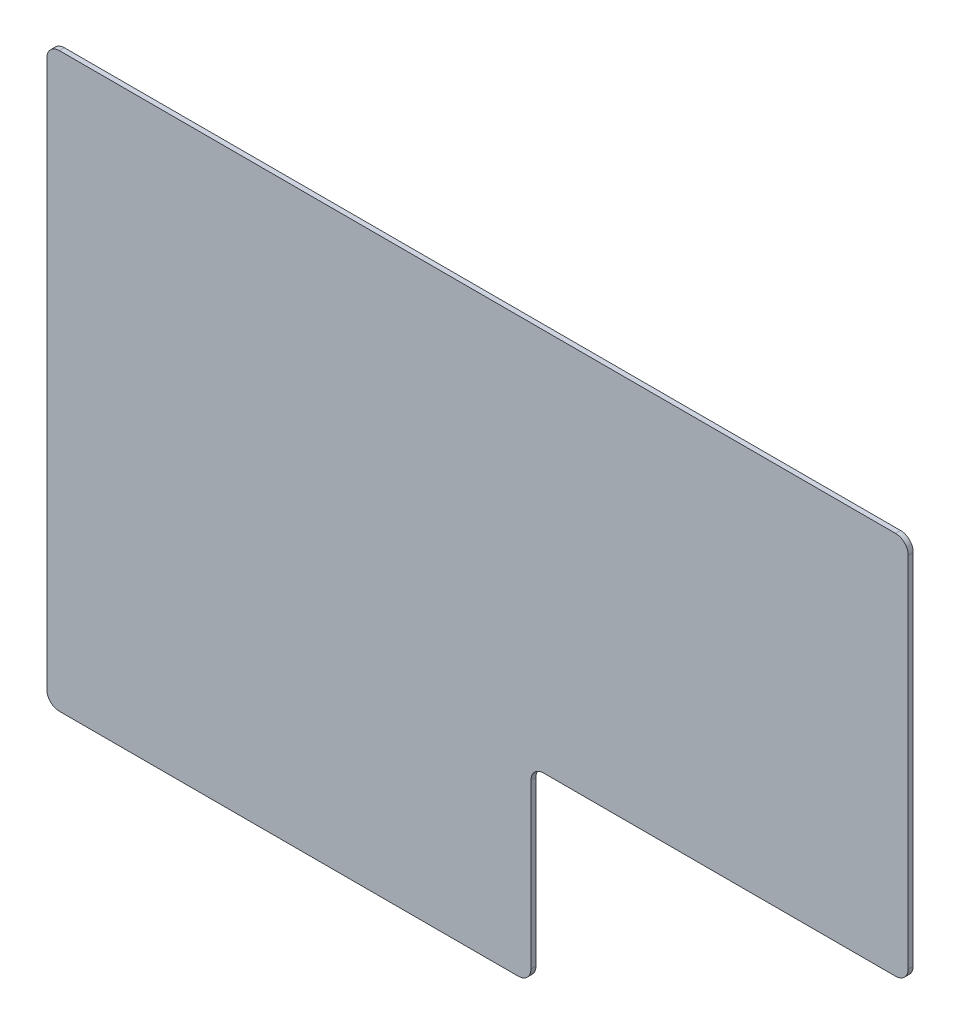
ISO-10303-21;
HEADER;
FILE_DESCRIPTION(('STEP AP214'),'2;1');
FILE_NAME('part.step','',(''),(''),'','','');
FILE_SCHEMA(('AUTOMOTIVE_DESIGN { 1 0 10303 214 1 1 1 1 }'));
ENDSEC;
DATA;
#1=APPLICATION_CONTEXT('core data for automotive mechanical design processes');
#2=APPLICATION_PROTOCOL_DEFINITION('international standard','automotive_design',2000,#1);
#3=PRODUCT_CONTEXT('',#1,'mechanical');
#4=PRODUCT('Part','Part','',(#3));
#5=PRODUCT_RELATED_PRODUCT_CATEGORY('part','',(#4));
#6=PRODUCT_DEFINITION_FORMATION('','',#4);
#7=PRODUCT_DEFINITION_CONTEXT('part definition',#1,'design');
#8=PRODUCT_DEFINITION('design','',#6,#7);
#9=PRODUCT_DEFINITION_SHAPE('','',#8);
#10=(LENGTH_UNIT() NAMED_UNIT(*) SI_UNIT(.MILLI.,.METRE.));
#11=(NAMED_UNIT(*) PLANE_ANGLE_UNIT() SI_UNIT($,.RADIAN.));
#12=(NAMED_UNIT(*) SI_UNIT($,.STERADIAN.) SOLID_ANGLE_UNIT());
#13=UNCERTAINTY_MEASURE_WITH_UNIT(LENGTH_MEASURE(1.E-05),#10,'distance_accuracy_value','');
#14=(GEOMETRIC_REPRESENTATION_CONTEXT(3) GLOBAL_UNCERTAINTY_ASSIGNED_CONTEXT((#13)) GLOBAL_UNIT_ASSIGNED_CONTEXT((#10,
#11,#12)) REPRESENTATION_CONTEXT('',''));
#15=CARTESIAN_POINT('',(0.,0.,0.));
#16=DIRECTION('',(0.,0.,1.));
#17=DIRECTION('',(1.,0.,0.));
#18=AXIS2_PLACEMENT_3D('',#15,#16,#17);
#19=CARTESIAN_POINT('',(-0.0949999999996768,0.164999999999999,0.));
#20=DIRECTION('',(0.,0.,1.));
#21=DIRECTION('',(1.,0.,0.));
#22=AXIS2_PLACEMENT_3D('',#19,#20,#21);
#23=PLANE('',#22);
#24=DIRECTION('',(0.,1.,0.));
#25=VECTOR('',#24,1.);
#26=CARTESIAN_POINT('',(-0.194999999999705,4.51500000150653,0.));
#27=LINE('',#26,#25);
#28=CARTESIAN_POINT('',(-0.194999999999676,0.164999999999999,0.));
#29=VERTEX_POINT('',#28);
#30=CARTESIAN_POINT('',(-0.194999999999705,4.51500000150653,0.));
#31=VERTEX_POINT('',#30);
#32=EDGE_CURVE('E106',#29,#31,#27,.T.);
#33=ORIENTED_EDGE('',*,*,#32,.T.);
#34=CARTESIAN_POINT('',(-0.0949999999997042,4.51500000150653,0.));
#35=DIRECTION('',(0.,0.,-1.));
#36=DIRECTION('',(-1.,0.,0.));
#37=AXIS2_PLACEMENT_3D('',#34,#35,#36);
#38=CIRCLE('',#37,0.100000000000001);
#39=CARTESIAN_POINT('',(-0.0949999999997038,4.61500000150653,0.));
#40=VERTEX_POINT('',#39);
#41=EDGE_CURVE('E129',#40,#31,#38,.F.);
#42=ORIENTED_EDGE('',*,*,#41,.F.);
#43=DIRECTION('',(1.,0.,0.));
#44=VECTOR('',#43,1.);
#45=CARTESIAN_POINT('',(6.5550000000003,4.61500000150653,0.));
#46=LINE('',#45,#44);
#47=CARTESIAN_POINT('',(6.5550000000003,4.61500000150653,0.));
#48=VERTEX_POINT('',#47);
#49=EDGE_CURVE('E126',#40,#48,#46,.T.);
#50=ORIENTED_EDGE('',*,*,#49,.T.);
#51=CARTESIAN_POINT('',(6.5550000000003,4.51500000150653,0.));
#52=DIRECTION('',(0.,0.,-1.));
#53=DIRECTION('',(-1.,0.,0.));
#54=AXIS2_PLACEMENT_3D('',#51,#52,#53);
#55=CIRCLE('',#54,0.1);
#56=CARTESIAN_POINT('',(6.6550000000003,4.51500000150653,0.));
#57=VERTEX_POINT('',#56);
#58=EDGE_CURVE('E134',#57,#48,#55,.F.);
#59=ORIENTED_EDGE('',*,*,#58,.F.);
#60=DIRECTION('',(0.,-1.,0.));
#61=VECTOR('',#60,1.);
#62=CARTESIAN_POINT('',(6.65500000000032,1.665,0.));
#63=LINE('',#62,#61);
#64=CARTESIAN_POINT('',(6.65500000000032,1.665,0.));
#65=VERTEX_POINT('',#64);
#66=EDGE_CURVE('E131',#57,#65,#63,.T.);
#67=ORIENTED_EDGE('',*,*,#66,.T.);
#68=CARTESIAN_POINT('',(6.55500000000032,1.665,0.));
#69=DIRECTION('',(0.,0.,-1.));
#70=DIRECTION('',(-1.,0.,0.));
#71=AXIS2_PLACEMENT_3D('',#68,#69,#70);
#72=CIRCLE('',#71,0.0999999999999994);
#73=CARTESIAN_POINT('',(6.55500000000032,1.565,0.));
#74=VERTEX_POINT('',#73);
#75=EDGE_CURVE('E139',#74,#65,#72,.F.);
#76=ORIENTED_EDGE('',*,*,#75,.F.);
#77=DIRECTION('',(1.,0.,0.));
#78=VECTOR('',#77,1.);
#79=CARTESIAN_POINT('',(3.75500000107356,1.565,0.));
#80=LINE('',#79,#78);
#81=CARTESIAN_POINT('',(3.75500000107356,1.565,0.));
#82=VERTEX_POINT('',#81);
#83=EDGE_CURVE('E136',#74,#82,#80,.F.);
#84=ORIENTED_EDGE('',*,*,#83,.T.);
#85=CARTESIAN_POINT('',(3.75500000107356,1.465,0.));
#86=DIRECTION('',(0.,0.,-1.));
#87=DIRECTION('',(-1.,0.,0.));
#88=AXIS2_PLACEMENT_3D('',#85,#86,#87);
#89=CIRCLE('',#88,0.0999999999999998);
#90=CARTESIAN_POINT('',(3.65500000107356,1.465,0.));
#91=VERTEX_POINT('',#90);
#92=EDGE_CURVE('E172',#82,#91,#89,.F.);
#93=ORIENTED_EDGE('',*,*,#92,.T.);
#94=DIRECTION('',(0.,-1.,0.));
#95=VECTOR('',#94,1.);
#96=CARTESIAN_POINT('',(3.65500000107357,0.164999999999999,0.));
#97=LINE('',#96,#95);
#98=CARTESIAN_POINT('',(3.65500000107357,0.164999999999998,0.));
#99=VERTEX_POINT('',#98);
#100=EDGE_CURVE('E141',#91,#99,#97,.T.);
#101=ORIENTED_EDGE('',*,*,#100,.T.);
#102=CARTESIAN_POINT('',(3.55500000107357,0.164999999999998,0.));
#103=DIRECTION('',(0.,0.,-1.));
#104=DIRECTION('',(-1.,0.,0.));
#105=AXIS2_PLACEMENT_3D('',#102,#103,#104);
#106=CIRCLE('',#105,0.099999999999999);
#107=CARTESIAN_POINT('',(3.55500000107357,0.0649999999999992,0.));
#108=VERTEX_POINT('',#107);
#109=EDGE_CURVE('E147',#108,#99,#106,.F.);
#110=ORIENTED_EDGE('',*,*,#109,.F.);
#111=DIRECTION('',(1.,0.,0.));
#112=VECTOR('',#111,1.);
#113=CARTESIAN_POINT('',(-0.094999999999678,0.0649999999999991,0.));
#114=LINE('',#113,#112);
#115=CARTESIAN_POINT('',(-0.0949999999996774,0.0649999999999991,0.));
#116=VERTEX_POINT('',#115);
#117=EDGE_CURVE('E108',#108,#116,#114,.F.);
#118=ORIENTED_EDGE('',*,*,#117,.T.);
#119=CARTESIAN_POINT('',(-0.0949999999996768,0.164999999999999,0.));
#120=DIRECTION('',(0.,0.,-1.));
#121=DIRECTION('',(-1.,0.,0.));
#122=AXIS2_PLACEMENT_3D('',#119,#120,#121);
#123=CIRCLE('',#122,0.0999999999999995);
#124=EDGE_CURVE('E20',#29,#116,#123,.F.);
#125=ORIENTED_EDGE('',*,*,#124,.F.);
#126=EDGE_LOOP('',(#33,#42,#50,#59,#67,#76,#84,#93,#101,#110,#118,#125));
#127=FACE_BOUND('',#126,.T.);
#128=ADVANCED_FACE('F17',(#127),#23,.F.);
#129=CARTESIAN_POINT('',(-0.0949999999996768,0.164999999999999,0.04));
#130=DIRECTION('',(0.,0.,-1.));
#131=DIRECTION('',(-1.,0.,0.));
#132=AXIS2_PLACEMENT_3D('',#129,#130,#131);
#133=CYLINDRICAL_SURFACE('',#132,0.0999999999999995);
#134=CARTESIAN_POINT('',(-0.0949999999996768,0.164999999999999,0.04));
#135=DIRECTION('',(0.,0.,-1.));
#136=DIRECTION('',(-1.,0.,0.));
#137=AXIS2_PLACEMENT_3D('',#134,#135,#136);
#138=CIRCLE('',#137,0.0999999999999995);
#139=CARTESIAN_POINT('',(-0.194999999999691,0.164999999999999,0.04));
#140=VERTEX_POINT('',#139);
#141=CARTESIAN_POINT('',(-0.0949999999996774,0.0649999999999991,0.04));
#142=VERTEX_POINT('',#141);
#143=EDGE_CURVE('E116',#140,#142,#138,.F.);
#144=ORIENTED_EDGE('',*,*,#143,.F.);
#145=DIRECTION('',(0.,0.,1.));
#146=VECTOR('',#145,1.);
#147=CARTESIAN_POINT('',(-0.194999999999676,0.164999999999999,0.04));
#148=LINE('',#147,#146);
#149=EDGE_CURVE('E113',#140,#29,#148,.F.);
#150=ORIENTED_EDGE('',*,*,#149,.T.);
#151=ORIENTED_EDGE('',*,*,#124,.T.);
#152=DIRECTION('',(0.,0.,1.));
#153=VECTOR('',#152,1.);
#154=CARTESIAN_POINT('',(-0.094999999999678,0.0649999999999991,0.04));
#155=LINE('',#154,#153);
#156=EDGE_CURVE('E111',#116,#142,#155,.T.);
#157=ORIENTED_EDGE('',*,*,#156,.T.);
#158=EDGE_LOOP('',(#144,#150,#151,#157));
#159=FACE_BOUND('',#158,.T.);
#160=ADVANCED_FACE('F114',(#159),#133,.T.);
#161=CARTESIAN_POINT('',(-0.094999999999678,0.0649999999999991,0.04));
#162=DIRECTION('',(0.,1.,0.));
#163=DIRECTION('',(0.,0.,1.));
#164=AXIS2_PLACEMENT_3D('',#161,#162,#163);
#165=PLANE('',#164);
#166=DIRECTION('',(0.,0.,-1.));
#167=VECTOR('',#166,1.);
#168=CARTESIAN_POINT('',(3.55500000107357,0.0649999999999993,0.04));
#169=LINE('',#168,#167);
#170=CARTESIAN_POINT('',(3.55500000107357,0.0649999999999992,0.04));
#171=VERTEX_POINT('',#170);
#172=EDGE_CURVE('E174',#171,#108,#169,.T.);
#173=ORIENTED_EDGE('',*,*,#172,.F.);
#174=DIRECTION('',(1.,0.,0.));
#175=VECTOR('',#174,1.);
#176=CARTESIAN_POINT('',(-0.0949999999996768,0.0649999999999991,0.04));
#177=LINE('',#176,#175);
#178=EDGE_CURVE('E121',#142,#171,#177,.T.);
#179=ORIENTED_EDGE('',*,*,#178,.F.);
#180=ORIENTED_EDGE('',*,*,#156,.F.);
#181=ORIENTED_EDGE('',*,*,#117,.F.);
#182=EDGE_LOOP('',(#173,#179,#180,#181));
#183=FACE_BOUND('',#182,.T.);
#184=ADVANCED_FACE('F311',(#183),#165,.F.);
#185=CARTESIAN_POINT('',(3.55500000107357,0.164999999999998,0.04));
#186=DIRECTION('',(0.,0.,-1.));
#187=DIRECTION('',(-1.,0.,0.));
#188=AXIS2_PLACEMENT_3D('',#185,#186,#187);
#189=CYLINDRICAL_SURFACE('',#188,0.099999999999999);
#190=CARTESIAN_POINT('',(3.55500000107357,0.164999999999998,0.04));
#191=DIRECTION('',(0.,0.,-1.));
#192=DIRECTION('',(-1.,0.,0.));
#193=AXIS2_PLACEMENT_3D('',#190,#191,#192);
#194=CIRCLE('',#193,0.099999999999999);
#195=CARTESIAN_POINT('',(3.65500000107357,0.164999999999998,0.04));
#196=VERTEX_POINT('',#195);
#197=EDGE_CURVE('E163',#171,#196,#194,.F.);
#198=ORIENTED_EDGE('',*,*,#197,.F.);
#199=ORIENTED_EDGE('',*,*,#172,.T.);
#200=ORIENTED_EDGE('',*,*,#109,.T.);
#201=DIRECTION('',(0.,0.,1.));
#202=VECTOR('',#201,1.);
#203=CARTESIAN_POINT('',(3.65500000107357,0.164999999999998,0.04));
#204=LINE('',#203,#202);
#205=EDGE_CURVE('E145',#99,#196,#204,.T.);
#206=ORIENTED_EDGE('',*,*,#205,.T.);
#207=EDGE_LOOP('',(#198,#199,#200,#206));
#208=FACE_BOUND('',#207,.T.);
#209=ADVANCED_FACE('F301',(#208),#189,.T.);
#210=CARTESIAN_POINT('',(3.65500000107357,0.164999999999999,0.04));
#211=DIRECTION('',(-1.,0.,0.));
#212=DIRECTION('',(0.,-1.,0.));
#213=AXIS2_PLACEMENT_3D('',#210,#211,#212);
#214=PLANE('',#213);
#215=DIRECTION('',(0.,0.,-1.));
#216=VECTOR('',#215,1.);
#217=CARTESIAN_POINT('',(3.65500000107356,1.465,0.04));
#218=LINE('',#217,#216);
#219=CARTESIAN_POINT('',(3.65500000107357,1.465,0.04));
#220=VERTEX_POINT('',#219);
#221=EDGE_CURVE('E144',#91,#220,#218,.F.);
#222=ORIENTED_EDGE('',*,*,#221,.T.);
#223=DIRECTION('',(0.,1.,0.));
#224=VECTOR('',#223,1.);
#225=CARTESIAN_POINT('',(3.65500000107357,0.164999999999999,0.04));
#226=LINE('',#225,#224);
#227=EDGE_CURVE('E162',#196,#220,#226,.T.);
#228=ORIENTED_EDGE('',*,*,#227,.F.);
#229=ORIENTED_EDGE('',*,*,#205,.F.);
#230=ORIENTED_EDGE('',*,*,#100,.F.);
#231=EDGE_LOOP('',(#222,#228,#229,#230));
#232=FACE_BOUND('',#231,.T.);
#233=ADVANCED_FACE('F291',(#232),#214,.F.);
#234=CARTESIAN_POINT('',(3.75500000107356,1.465,0.04));
#235=DIRECTION('',(0.,0.,-1.));
#236=DIRECTION('',(-1.,0.,0.));
#237=AXIS2_PLACEMENT_3D('',#234,#235,#236);
#238=CYLINDRICAL_SURFACE('',#237,0.0999999999999998);
#239=DIRECTION('',(0.,0.,1.));
#240=VECTOR('',#239,1.);
#241=CARTESIAN_POINT('',(3.75500000107356,1.565,0.04));
#242=LINE('',#241,#240);
#243=CARTESIAN_POINT('',(3.75500000107356,1.565,0.04));
#244=VERTEX_POINT('',#243);
#245=EDGE_CURVE('E140',#82,#244,#242,.T.);
#246=ORIENTED_EDGE('',*,*,#245,.T.);
#247=CARTESIAN_POINT('',(3.75500000107356,1.465,0.04));
#248=DIRECTION('',(0.,0.,-1.));
#249=DIRECTION('',(-1.,0.,0.));
#250=AXIS2_PLACEMENT_3D('',#247,#248,#249);
#251=CIRCLE('',#250,0.0999999999999998);
#252=EDGE_CURVE('E159',#220,#244,#251,.T.);
#253=ORIENTED_EDGE('',*,*,#252,.F.);
#254=ORIENTED_EDGE('',*,*,#221,.F.);
#255=ORIENTED_EDGE('',*,*,#92,.F.);
#256=EDGE_LOOP('',(#246,#253,#254,#255));
#257=FACE_BOUND('',#256,.T.);
#258=ADVANCED_FACE('F281',(#257),#238,.F.);
#259=CARTESIAN_POINT('',(3.75500000107356,1.565,0.04));
#260=DIRECTION('',(0.,1.,0.));
#261=DIRECTION('',(0.,0.,1.));
#262=AXIS2_PLACEMENT_3D('',#259,#260,#261);
#263=PLANE('',#262);
#264=DIRECTION('',(0.,0.,-1.));
#265=VECTOR('',#264,1.);
#266=CARTESIAN_POINT('',(6.55500000000032,1.565,0.04));
#267=LINE('',#266,#265);
#268=CARTESIAN_POINT('',(6.55500000000032,1.565,0.04));
#269=VERTEX_POINT('',#268);
#270=EDGE_CURVE('E171',#269,#74,#267,.T.);
#271=ORIENTED_EDGE('',*,*,#270,.F.);
#272=DIRECTION('',(1.,0.,0.));
#273=VECTOR('',#272,1.);
#274=CARTESIAN_POINT('',(-0.0949999999996768,1.565,0.04));
#275=LINE('',#274,#273);
#276=EDGE_CURVE('E158',#244,#269,#275,.T.);
#277=ORIENTED_EDGE('',*,*,#276,.F.);
#278=ORIENTED_EDGE('',*,*,#245,.F.);
#279=ORIENTED_EDGE('',*,*,#83,.F.);
#280=EDGE_LOOP('',(#271,#277,#278,#279));
#281=FACE_BOUND('',#280,.T.);
#282=ADVANCED_FACE('F271',(#281),#263,.F.);
#283=CARTESIAN_POINT('',(6.55500000000032,1.665,0.04));
#284=DIRECTION('',(0.,0.,-1.));
#285=DIRECTION('',(-1.,0.,0.));
#286=AXIS2_PLACEMENT_3D('',#283,#284,#285);
#287=CYLINDRICAL_SURFACE('',#286,0.0999999999999994);
#288=CARTESIAN_POINT('',(6.55500000000032,1.665,0.04));
#289=DIRECTION('',(0.,0.,-1.));
#290=DIRECTION('',(-1.,0.,0.));
#291=AXIS2_PLACEMENT_3D('',#288,#289,#290);
#292=CIRCLE('',#291,0.0999999999999994);
#293=CARTESIAN_POINT('',(6.65500000000032,1.665,0.04));
#294=VERTEX_POINT('',#293);
#295=EDGE_CURVE('E155',#269,#294,#292,.F.);
#296=ORIENTED_EDGE('',*,*,#295,.F.);
#297=ORIENTED_EDGE('',*,*,#270,.T.);
#298=ORIENTED_EDGE('',*,*,#75,.T.);
#299=DIRECTION('',(0.,0.,1.));
#300=VECTOR('',#299,1.);
#301=CARTESIAN_POINT('',(6.65500000000032,1.665,0.04));
#302=LINE('',#301,#300);
#303=EDGE_CURVE('E135',#65,#294,#302,.T.);
#304=ORIENTED_EDGE('',*,*,#303,.T.);
#305=EDGE_LOOP('',(#296,#297,#298,#304));
#306=FACE_BOUND('',#305,.T.);
#307=ADVANCED_FACE('F261',(#306),#287,.T.);
#308=CARTESIAN_POINT('',(6.65500000000032,1.665,0.04));
#309=DIRECTION('',(-1.,0.,0.));
#310=DIRECTION('',(0.,-1.,0.));
#311=AXIS2_PLACEMENT_3D('',#308,#309,#310);
#312=PLANE('',#311);
#313=DIRECTION('',(0.,0.,-1.));
#314=VECTOR('',#313,1.);
#315=CARTESIAN_POINT('',(6.6550000000003,4.51500000150653,0.04));
#316=LINE('',#315,#314);
#317=CARTESIAN_POINT('',(6.65500000000031,4.51500000150653,0.04));
#318=VERTEX_POINT('',#317);
#319=EDGE_CURVE('E169',#318,#57,#316,.T.);
#320=ORIENTED_EDGE('',*,*,#319,.F.);
#321=DIRECTION('',(0.,1.,0.));
#322=VECTOR('',#321,1.);
#323=CARTESIAN_POINT('',(6.65500000000032,0.164999999999999,0.04));
#324=LINE('',#323,#322);
#325=EDGE_CURVE('E154',#294,#318,#324,.T.);
#326=ORIENTED_EDGE('',*,*,#325,.F.);
#327=ORIENTED_EDGE('',*,*,#303,.F.);
#328=ORIENTED_EDGE('',*,*,#66,.F.);
#329=EDGE_LOOP('',(#320,#326,#327,#328));
#330=FACE_BOUND('',#329,.T.);
#331=ADVANCED_FACE('F251',(#330),#312,.F.);
#332=CARTESIAN_POINT('',(6.5550000000003,4.51500000150653,0.04));
#333=DIRECTION('',(0.,0.,-1.));
#334=DIRECTION('',(-1.,0.,0.));
#335=AXIS2_PLACEMENT_3D('',#332,#333,#334);
#336=CYLINDRICAL_SURFACE('',#335,0.1);
#337=CARTESIAN_POINT('',(6.5550000000003,4.51500000150653,0.04));
#338=DIRECTION('',(0.,0.,-1.));
#339=DIRECTION('',(-1.,0.,0.));
#340=AXIS2_PLACEMENT_3D('',#337,#338,#339);
#341=CIRCLE('',#340,0.1);
#342=CARTESIAN_POINT('',(6.5550000000003,4.61500000150653,0.04));
#343=VERTEX_POINT('',#342);
#344=EDGE_CURVE('E151',#318,#343,#341,.F.);
#345=ORIENTED_EDGE('',*,*,#344,.F.);
#346=ORIENTED_EDGE('',*,*,#319,.T.);
#347=ORIENTED_EDGE('',*,*,#58,.T.);
#348=DIRECTION('',(0.,0.,1.));
#349=VECTOR('',#348,1.);
#350=CARTESIAN_POINT('',(6.5550000000003,4.61500000150653,0.04));
#351=LINE('',#350,#349);
#352=EDGE_CURVE('E130',#48,#343,#351,.T.);
#353=ORIENTED_EDGE('',*,*,#352,.T.);
#354=EDGE_LOOP('',(#345,#346,#347,#353));
#355=FACE_BOUND('',#354,.T.);
#356=ADVANCED_FACE('F217',(#355),#336,.T.);
#357=CARTESIAN_POINT('',(6.5550000000003,4.61500000150653,0.04));
#358=DIRECTION('',(0.,-1.,0.));
#359=DIRECTION('',(1.,0.,0.));
#360=AXIS2_PLACEMENT_3D('',#357,#358,#359);
#361=PLANE('',#360);
#362=DIRECTION('',(0.,0.,-1.));
#363=VECTOR('',#362,1.);
#364=CARTESIAN_POINT('',(-0.0949999999997035,4.61500000150653,0.04));
#365=LINE('',#364,#363);
#366=CARTESIAN_POINT('',(-0.0949999999997038,4.61500000150653,0.04));
#367=VERTEX_POINT('',#366);
#368=EDGE_CURVE('E167',#367,#40,#365,.T.);
#369=ORIENTED_EDGE('',*,*,#368,.F.);
#370=DIRECTION('',(1.,0.,0.));
#371=VECTOR('',#370,1.);
#372=CARTESIAN_POINT('',(-0.0949999999996768,4.61500000150653,0.04));
#373=LINE('',#372,#371);
#374=EDGE_CURVE('E150',#343,#367,#373,.F.);
#375=ORIENTED_EDGE('',*,*,#374,.F.);
#376=ORIENTED_EDGE('',*,*,#352,.F.);
#377=ORIENTED_EDGE('',*,*,#49,.F.);
#378=EDGE_LOOP('',(#369,#375,#376,#377));
#379=FACE_BOUND('',#378,.T.);
#380=ADVANCED_FACE('F206',(#379),#361,.F.);
#381=CARTESIAN_POINT('',(-0.0949999999997042,4.51500000150653,0.04));
#382=DIRECTION('',(0.,0.,-1.));
#383=DIRECTION('',(-1.,0.,0.));
#384=AXIS2_PLACEMENT_3D('',#381,#382,#383);
#385=CYLINDRICAL_SURFACE('',#384,0.100000000000001);
#386=CARTESIAN_POINT('',(-0.0949999999997042,4.51500000150653,0.04));
#387=DIRECTION('',(0.,0.,-1.));
#388=DIRECTION('',(-1.,0.,0.));
#389=AXIS2_PLACEMENT_3D('',#386,#387,#388);
#390=CIRCLE('',#389,0.100000000000001);
#391=CARTESIAN_POINT('',(-0.194999999999705,4.51500000150653,0.04));
#392=VERTEX_POINT('',#391);
#393=EDGE_CURVE('E26',#367,#392,#390,.F.);
#394=ORIENTED_EDGE('',*,*,#393,.F.);
#395=ORIENTED_EDGE('',*,*,#368,.T.);
#396=ORIENTED_EDGE('',*,*,#41,.T.);
#397=DIRECTION('',(0.,0.,1.));
#398=VECTOR('',#397,1.);
#399=CARTESIAN_POINT('',(-0.194999999999705,4.51500000150653,0.04));
#400=LINE('',#399,#398);
#401=EDGE_CURVE('E35',#31,#392,#400,.T.);
#402=ORIENTED_EDGE('',*,*,#401,.T.);
#403=EDGE_LOOP('',(#394,#395,#396,#402));
#404=FACE_BOUND('',#403,.T.);
#405=ADVANCED_FACE('F208',(#404),#385,.T.);
#406=CARTESIAN_POINT('',(-0.194999999999705,4.51500000150653,0.04));
#407=DIRECTION('',(1.,0.,0.));
#408=DIRECTION('',(0.,1.,0.));
#409=AXIS2_PLACEMENT_3D('',#406,#407,#408);
#410=PLANE('',#409);
#411=ORIENTED_EDGE('',*,*,#149,.F.);
#412=DIRECTION('',(0.,1.,0.));
#413=VECTOR('',#412,1.);
#414=CARTESIAN_POINT('',(-0.194999999999705,0.164999999999999,0.04));
#415=LINE('',#414,#413);
#416=EDGE_CURVE('E11',#392,#140,#415,.F.);
#417=ORIENTED_EDGE('',*,*,#416,.F.);
#418=ORIENTED_EDGE('',*,*,#401,.F.);
#419=ORIENTED_EDGE('',*,*,#32,.F.);
#420=EDGE_LOOP('',(#411,#417,#418,#419));
#421=FACE_BOUND('',#420,.T.);
#422=ADVANCED_FACE('F119',(#421),#410,.F.);
#423=CARTESIAN_POINT('',(-0.0949999999996768,0.164999999999999,0.04));
#424=DIRECTION('',(0.,0.,1.));
#425=DIRECTION('',(1.,0.,0.));
#426=AXIS2_PLACEMENT_3D('',#423,#424,#425);
#427=PLANE('',#426);
#428=ORIENTED_EDGE('',*,*,#393,.T.);
#429=ORIENTED_EDGE('',*,*,#416,.T.);
#430=ORIENTED_EDGE('',*,*,#143,.T.);
#431=ORIENTED_EDGE('',*,*,#178,.T.);
#432=ORIENTED_EDGE('',*,*,#197,.T.);
#433=ORIENTED_EDGE('',*,*,#227,.T.);
#434=ORIENTED_EDGE('',*,*,#252,.T.);
#435=ORIENTED_EDGE('',*,*,#276,.T.);
#436=ORIENTED_EDGE('',*,*,#295,.T.);
#437=ORIENTED_EDGE('',*,*,#325,.T.);
#438=ORIENTED_EDGE('',*,*,#344,.T.);
#439=ORIENTED_EDGE('',*,*,#374,.T.);
#440=EDGE_LOOP('',(#428,#429,#430,#431,#432,#433,#434,#435,#436,#437,#438,#439));
#441=FACE_BOUND('',#440,.T.);
#442=ADVANCED_FACE('F202',(#441),#427,.T.);
#443=CLOSED_SHELL('',(#128,#160,#184,#209,#233,#258,#282,#307,#331,#356,#380,#405,#422,#442));
#444=MANIFOLD_SOLID_BREP('B1',#443);
#445=ADVANCED_BREP_SHAPE_REPRESENTATION('',(#18,#444),#14);
#446=SHAPE_DEFINITION_REPRESENTATION(#9,#445);
ENDSEC;
END-ISO-10303-21;
